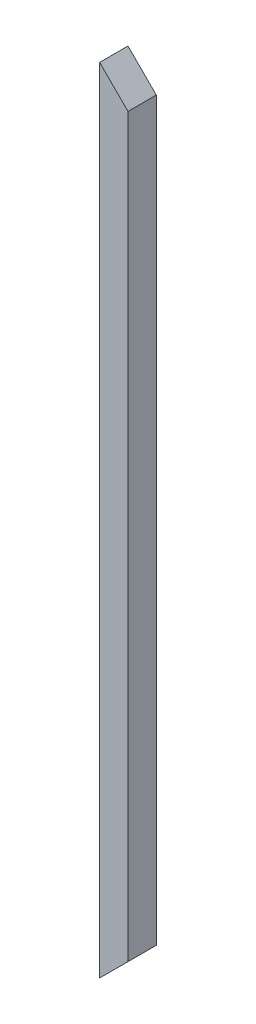
ISO-10303-21;
HEADER;
FILE_DESCRIPTION(('STEP AP214'),'2;1');
FILE_NAME('part.step','',(''),(''),'','','');
FILE_SCHEMA(('AUTOMOTIVE_DESIGN { 1 0 10303 214 1 1 1 1 }'));
ENDSEC;
DATA;
#1=APPLICATION_CONTEXT('core data for automotive mechanical design processes');
#2=APPLICATION_PROTOCOL_DEFINITION('international standard','automotive_design',2000,#1);
#3=PRODUCT_CONTEXT('',#1,'mechanical');
#4=PRODUCT('Part','Part','',(#3));
#5=PRODUCT_RELATED_PRODUCT_CATEGORY('part','',(#4));
#6=PRODUCT_DEFINITION_FORMATION('','',#4);
#7=PRODUCT_DEFINITION_CONTEXT('part definition',#1,'design');
#8=PRODUCT_DEFINITION('design','',#6,#7);
#9=PRODUCT_DEFINITION_SHAPE('','',#8);
#10=(LENGTH_UNIT() NAMED_UNIT(*) SI_UNIT(.MILLI.,.METRE.));
#11=(NAMED_UNIT(*) PLANE_ANGLE_UNIT() SI_UNIT($,.RADIAN.));
#12=(NAMED_UNIT(*) SI_UNIT($,.STERADIAN.) SOLID_ANGLE_UNIT());
#13=UNCERTAINTY_MEASURE_WITH_UNIT(LENGTH_MEASURE(1.E-05),#10,'distance_accuracy_value','');
#14=(GEOMETRIC_REPRESENTATION_CONTEXT(3) GLOBAL_UNCERTAINTY_ASSIGNED_CONTEXT((#13)) GLOBAL_UNIT_ASSIGNED_CONTEXT((#10,
#11,#12)) REPRESENTATION_CONTEXT('',''));
#15=CARTESIAN_POINT('',(0.,0.,0.));
#16=DIRECTION('',(0.,0.,1.));
#17=DIRECTION('',(1.,0.,0.));
#18=AXIS2_PLACEMENT_3D('',#15,#16,#17);
#19=CARTESIAN_POINT('',(-7.5,420.,-7.5));
#20=DIRECTION('',(1.,0.,0.));
#21=DIRECTION('',(0.,0.,-1.));
#22=AXIS2_PLACEMENT_3D('',#19,#20,#21);
#23=PLANE('',#22);
#24=DIRECTION('',(0.,0.,1.));
#25=VECTOR('',#24,1.);
#26=CARTESIAN_POINT('',(-7.5,0.,-7.5));
#27=LINE('',#26,#25);
#28=CARTESIAN_POINT('',(-7.5,0.,-7.5));
#29=VERTEX_POINT('',#28);
#30=CARTESIAN_POINT('',(-7.5,0.,7.5));
#31=VERTEX_POINT('',#30);
#32=EDGE_CURVE('E76',#29,#31,#27,.T.);
#33=ORIENTED_EDGE('',*,*,#32,.T.);
#34=DIRECTION('',(0.,-1.,0.));
#35=VECTOR('',#34,1.);
#36=CARTESIAN_POINT('',(-7.5,420.,7.5));
#37=LINE('',#36,#35);
#38=CARTESIAN_POINT('',(-7.5,420.,7.5));
#39=VERTEX_POINT('',#38);
#40=EDGE_CURVE('E11',#39,#31,#37,.T.);
#41=ORIENTED_EDGE('',*,*,#40,.F.);
#42=DIRECTION('',(0.,0.,1.));
#43=VECTOR('',#42,1.);
#44=CARTESIAN_POINT('',(-7.5,420.,-7.5));
#45=LINE('',#44,#43);
#46=CARTESIAN_POINT('',(-7.5,420.,-7.5));
#47=VERTEX_POINT('',#46);
#48=EDGE_CURVE('E67',#47,#39,#45,.T.);
#49=ORIENTED_EDGE('',*,*,#48,.F.);
#50=DIRECTION('',(0.,-1.,0.));
#51=VECTOR('',#50,1.);
#52=CARTESIAN_POINT('',(-7.5,420.,-7.5));
#53=LINE('',#52,#51);
#54=EDGE_CURVE('E75',#47,#29,#53,.T.);
#55=ORIENTED_EDGE('',*,*,#54,.T.);
#56=EDGE_LOOP('',(#33,#41,#49,#55));
#57=FACE_BOUND('',#56,.T.);
#58=ADVANCED_FACE('F33',(#57),#23,.F.);
#59=CARTESIAN_POINT('',(7.5,420.,7.5));
#60=DIRECTION('',(0.,0.,-1.));
#61=DIRECTION('',(-1.,0.,0.));
#62=AXIS2_PLACEMENT_3D('',#59,#60,#61);
#63=PLANE('',#62);
#64=DIRECTION('',(0.,-1.,0.));
#65=VECTOR('',#64,1.);
#66=CARTESIAN_POINT('',(7.5,420.,7.5));
#67=LINE('',#66,#65);
#68=CARTESIAN_POINT('',(7.5,405.,7.5));
#69=VERTEX_POINT('',#68);
#70=CARTESIAN_POINT('',(7.5,14.9999999999998,7.5));
#71=VERTEX_POINT('',#70);
#72=EDGE_CURVE('E41',#69,#71,#67,.T.);
#73=ORIENTED_EDGE('',*,*,#72,.F.);
#74=DIRECTION('',(0.707106781186543,-0.707106781186552,0.));
#75=VECTOR('',#74,1.);
#76=CARTESIAN_POINT('',(-7.5,420.,7.5));
#77=LINE('',#76,#75);
#78=EDGE_CURVE('E70',#39,#69,#77,.T.);
#79=ORIENTED_EDGE('',*,*,#78,.F.);
#80=ORIENTED_EDGE('',*,*,#40,.T.);
#81=DIRECTION('',(-0.707106781186551,-0.707106781186544,0.));
#82=VECTOR('',#81,1.);
#83=CARTESIAN_POINT('',(-7.5,0.,7.5));
#84=LINE('',#83,#82);
#85=EDGE_CURVE('E103',#71,#31,#84,.T.);
#86=ORIENTED_EDGE('',*,*,#85,.F.);
#87=EDGE_LOOP('',(#73,#79,#80,#86));
#88=FACE_BOUND('',#87,.T.);
#89=ADVANCED_FACE('F80',(#88),#63,.F.);
#90=CARTESIAN_POINT('',(7.5,420.,-7.5));
#91=DIRECTION('',(-1.,0.,0.));
#92=DIRECTION('',(0.,0.,1.));
#93=AXIS2_PLACEMENT_3D('',#90,#91,#92);
#94=PLANE('',#93);
#95=DIRECTION('',(0.,-1.,0.));
#96=VECTOR('',#95,1.);
#97=CARTESIAN_POINT('',(7.5,420.,-7.5));
#98=LINE('',#97,#96);
#99=CARTESIAN_POINT('',(7.5,405.,-7.5));
#100=VERTEX_POINT('',#99);
#101=CARTESIAN_POINT('',(7.5,14.9999999999998,-7.5));
#102=VERTEX_POINT('',#101);
#103=EDGE_CURVE('E94',#100,#102,#98,.T.);
#104=ORIENTED_EDGE('',*,*,#103,.F.);
#105=DIRECTION('',(0.,0.,1.));
#106=VECTOR('',#105,1.);
#107=CARTESIAN_POINT('',(7.5,405.,-22.5));
#108=LINE('',#107,#106);
#109=EDGE_CURVE('E84',#100,#69,#108,.T.);
#110=ORIENTED_EDGE('',*,*,#109,.T.);
#111=ORIENTED_EDGE('',*,*,#72,.T.);
#112=DIRECTION('',(0.,0.,1.));
#113=VECTOR('',#112,1.);
#114=CARTESIAN_POINT('',(7.5,14.9999999999998,-22.5));
#115=LINE('',#114,#113);
#116=EDGE_CURVE('E85',#102,#71,#115,.T.);
#117=ORIENTED_EDGE('',*,*,#116,.F.);
#118=EDGE_LOOP('',(#104,#110,#111,#117));
#119=FACE_BOUND('',#118,.T.);
#120=ADVANCED_FACE('F99',(#119),#94,.F.);
#121=CARTESIAN_POINT('',(7.5,420.,-7.5));
#122=DIRECTION('',(0.,0.,1.));
#123=DIRECTION('',(1.,0.,0.));
#124=AXIS2_PLACEMENT_3D('',#121,#122,#123);
#125=PLANE('',#124);
#126=ORIENTED_EDGE('',*,*,#54,.F.);
#127=DIRECTION('',(0.707106781186543,-0.707106781186552,0.));
#128=VECTOR('',#127,1.);
#129=CARTESIAN_POINT('',(0.,412.5,-7.5));
#130=LINE('',#129,#128);
#131=EDGE_CURVE('E47',#47,#100,#130,.T.);
#132=ORIENTED_EDGE('',*,*,#131,.T.);
#133=ORIENTED_EDGE('',*,*,#103,.T.);
#134=DIRECTION('',(-0.707106781186551,-0.707106781186544,0.));
#135=VECTOR('',#134,1.);
#136=CARTESIAN_POINT('',(210.,217.499999999998,-7.50000000000002));
#137=LINE('',#136,#135);
#138=EDGE_CURVE('E90',#102,#29,#137,.T.);
#139=ORIENTED_EDGE('',*,*,#138,.T.);
#140=EDGE_LOOP('',(#126,#132,#133,#139));
#141=FACE_BOUND('',#140,.T.);
#142=ADVANCED_FACE('F107',(#141),#125,.F.);
#143=CARTESIAN_POINT('',(-7.5,0.,-22.5));
#144=DIRECTION('',(-0.707106781186544,0.707106781186551,0.));
#145=DIRECTION('',(-0.707106781186551,-0.707106781186544,0.));
#146=AXIS2_PLACEMENT_3D('',#143,#144,#145);
#147=PLANE('',#146);
#148=ORIENTED_EDGE('',*,*,#116,.T.);
#149=ORIENTED_EDGE('',*,*,#85,.T.);
#150=ORIENTED_EDGE('',*,*,#32,.F.);
#151=ORIENTED_EDGE('',*,*,#138,.F.);
#152=EDGE_LOOP('',(#148,#149,#150,#151));
#153=FACE_BOUND('',#152,.T.);
#154=ADVANCED_FACE('F105',(#153),#147,.F.);
#155=CARTESIAN_POINT('',(-7.5,420.,-22.5));
#156=DIRECTION('',(-0.707106781186552,-0.707106781186543,0.));
#157=DIRECTION('',(0.707106781186543,-0.707106781186552,0.));
#158=AXIS2_PLACEMENT_3D('',#155,#156,#157);
#159=PLANE('',#158);
#160=ORIENTED_EDGE('',*,*,#48,.T.);
#161=ORIENTED_EDGE('',*,*,#78,.T.);
#162=ORIENTED_EDGE('',*,*,#109,.F.);
#163=ORIENTED_EDGE('',*,*,#131,.F.);
#164=EDGE_LOOP('',(#160,#161,#162,#163));
#165=FACE_BOUND('',#164,.T.);
#166=ADVANCED_FACE('F69',(#165),#159,.F.);
#167=CLOSED_SHELL('',(#58,#89,#120,#142,#154,#166));
#168=MANIFOLD_SOLID_BREP('B2',#167);
#169=ADVANCED_BREP_SHAPE_REPRESENTATION('',(#18,#168),#14);
#170=SHAPE_DEFINITION_REPRESENTATION(#9,#169);
ENDSEC;
END-ISO-10303-21;
